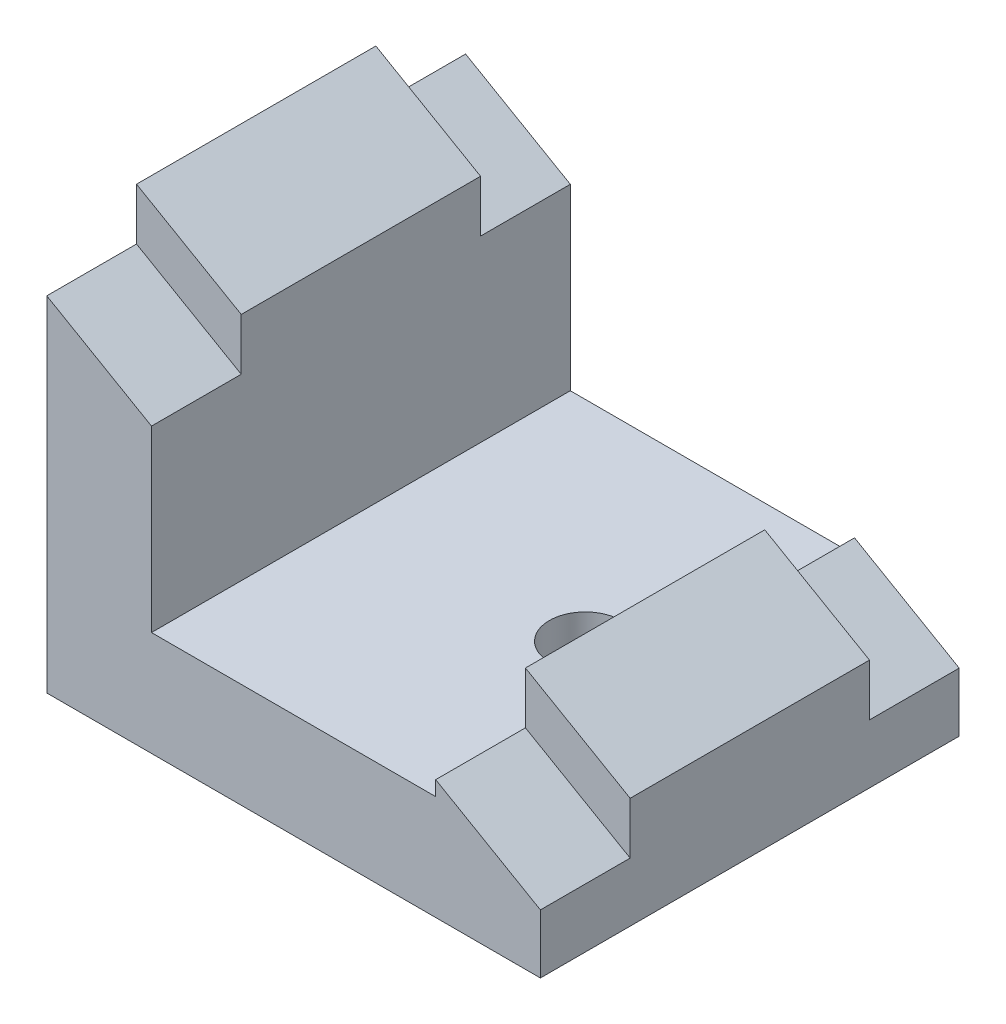
ISO-10303-21;
HEADER;
FILE_DESCRIPTION(('STEP AP214'),'2;1');
FILE_NAME('part.step','',(''),(''),'','','');
FILE_SCHEMA(('AUTOMOTIVE_DESIGN { 1 0 10303 214 1 1 1 1 }'));
ENDSEC;
DATA;
#1=APPLICATION_CONTEXT('core data for automotive mechanical design processes');
#2=APPLICATION_PROTOCOL_DEFINITION('international standard','automotive_design',2000,#1);
#3=PRODUCT_CONTEXT('',#1,'mechanical');
#4=PRODUCT('Part','Part','',(#3));
#5=PRODUCT_RELATED_PRODUCT_CATEGORY('part','',(#4));
#6=PRODUCT_DEFINITION_FORMATION('','',#4);
#7=PRODUCT_DEFINITION_CONTEXT('part definition',#1,'design');
#8=PRODUCT_DEFINITION('design','',#6,#7);
#9=PRODUCT_DEFINITION_SHAPE('','',#8);
#10=(LENGTH_UNIT() NAMED_UNIT(*) SI_UNIT(.MILLI.,.METRE.));
#11=(NAMED_UNIT(*) PLANE_ANGLE_UNIT() SI_UNIT($,.RADIAN.));
#12=(NAMED_UNIT(*) SI_UNIT($,.STERADIAN.) SOLID_ANGLE_UNIT());
#13=UNCERTAINTY_MEASURE_WITH_UNIT(LENGTH_MEASURE(1.E-05),#10,'distance_accuracy_value','');
#14=(GEOMETRIC_REPRESENTATION_CONTEXT(3) GLOBAL_UNCERTAINTY_ASSIGNED_CONTEXT((#13)) GLOBAL_UNIT_ASSIGNED_CONTEXT((#10,
#11,#12)) REPRESENTATION_CONTEXT('',''));
#15=CARTESIAN_POINT('',(0.,0.,0.));
#16=DIRECTION('',(0.,0.,1.));
#17=DIRECTION('',(1.,0.,0.));
#18=AXIS2_PLACEMENT_3D('',#15,#16,#17);
#19=CARTESIAN_POINT('',(4.,0.,7.));
#20=DIRECTION('',(1.,0.,0.));
#21=DIRECTION('',(0.,0.,-1.));
#22=AXIS2_PLACEMENT_3D('',#19,#20,#21);
#23=PLANE('',#22);
#24=DIRECTION('',(0.,1.,0.));
#25=VECTOR('',#24,1.);
#26=CARTESIAN_POINT('',(4.,0.,3.11561722730356));
#27=LINE('',#26,#25);
#28=CARTESIAN_POINT('',(4.00000000000001,0.,3.11561722730356));
#29=VERTEX_POINT('',#28);
#30=CARTESIAN_POINT('',(4.,2.,3.11561722730356));
#31=VERTEX_POINT('',#30);
#32=EDGE_CURVE('E182',#29,#31,#27,.T.);
#33=ORIENTED_EDGE('',*,*,#32,.F.);
#34=DIRECTION('',(0.,0.,-1.));
#35=VECTOR('',#34,1.);
#36=CARTESIAN_POINT('',(4.,0.,7.));
#37=LINE('',#36,#35);
#38=CARTESIAN_POINT('',(4.,0.,7.));
#39=VERTEX_POINT('',#38);
#40=EDGE_CURVE('E318',#39,#29,#37,.T.);
#41=ORIENTED_EDGE('',*,*,#40,.F.);
#42=DIRECTION('',(0.,-1.,0.));
#43=VECTOR('',#42,1.);
#44=CARTESIAN_POINT('',(4.,0.,7.));
#45=LINE('',#44,#43);
#46=CARTESIAN_POINT('',(4.,11.4974226119292,7.));
#47=VERTEX_POINT('',#46);
#48=EDGE_CURVE('E301',#47,#39,#45,.T.);
#49=ORIENTED_EDGE('',*,*,#48,.F.);
#50=DIRECTION('',(0.,0.,-1.));
#51=VECTOR('',#50,1.);
#52=CARTESIAN_POINT('',(4.,11.4974226119292,7.));
#53=LINE('',#52,#51);
#54=CARTESIAN_POINT('',(4.,11.4974226119292,4.));
#55=VERTEX_POINT('',#54);
#56=EDGE_CURVE('E59',#47,#55,#53,.T.);
#57=ORIENTED_EDGE('',*,*,#56,.T.);
#58=DIRECTION('',(0.,-1.,0.));
#59=VECTOR('',#58,1.);
#60=CARTESIAN_POINT('',(4.,13.2294734194974,4.));
#61=LINE('',#60,#59);
#62=CARTESIAN_POINT('',(4.,13.2294734194974,4.));
#63=VERTEX_POINT('',#62);
#64=EDGE_CURVE('E222',#63,#55,#61,.T.);
#65=ORIENTED_EDGE('',*,*,#64,.F.);
#66=DIRECTION('',(0.,0.,-1.));
#67=VECTOR('',#66,1.);
#68=CARTESIAN_POINT('',(4.,13.2294734194974,7.));
#69=LINE('',#68,#67);
#70=CARTESIAN_POINT('',(4.,13.2294734194974,-4.));
#71=VERTEX_POINT('',#70);
#72=EDGE_CURVE('E321',#63,#71,#69,.T.);
#73=ORIENTED_EDGE('',*,*,#72,.T.);
#74=DIRECTION('',(0.,-1.,0.));
#75=VECTOR('',#74,1.);
#76=CARTESIAN_POINT('',(4.,13.2294734194974,-4.));
#77=LINE('',#76,#75);
#78=CARTESIAN_POINT('',(4.,11.4974226119292,-4.));
#79=VERTEX_POINT('',#78);
#80=EDGE_CURVE('E257',#71,#79,#77,.T.);
#81=ORIENTED_EDGE('',*,*,#80,.T.);
#82=DIRECTION('',(0.,0.,1.));
#83=VECTOR('',#82,1.);
#84=CARTESIAN_POINT('',(4.,11.4974226119292,-7.));
#85=LINE('',#84,#83);
#86=CARTESIAN_POINT('',(4.,11.4974226119292,-7.));
#87=VERTEX_POINT('',#86);
#88=EDGE_CURVE('E252',#87,#79,#85,.T.);
#89=ORIENTED_EDGE('',*,*,#88,.F.);
#90=DIRECTION('',(0.,-1.,0.));
#91=VECTOR('',#90,1.);
#92=CARTESIAN_POINT('',(4.,0.,-7.));
#93=LINE('',#92,#91);
#94=CARTESIAN_POINT('',(4.,0.,-7.));
#95=VERTEX_POINT('',#94);
#96=EDGE_CURVE('E291',#87,#95,#93,.T.);
#97=ORIENTED_EDGE('',*,*,#96,.T.);
#98=CARTESIAN_POINT('',(4.,0.,-3.11561722730356));
#99=VERTEX_POINT('',#98);
#100=EDGE_CURVE('E303',#99,#95,#37,.T.);
#101=ORIENTED_EDGE('',*,*,#100,.F.);
#102=DIRECTION('',(0.,1.,0.));
#103=VECTOR('',#102,1.);
#104=CARTESIAN_POINT('',(4.,0.,-3.11561722730356));
#105=LINE('',#104,#103);
#106=CARTESIAN_POINT('',(4.,2.,-3.11561722730356));
#107=VERTEX_POINT('',#106);
#108=EDGE_CURVE('E51',#99,#107,#105,.T.);
#109=ORIENTED_EDGE('',*,*,#108,.T.);
#110=DIRECTION('',(0.,0.,1.));
#111=VECTOR('',#110,1.);
#112=CARTESIAN_POINT('',(4.,2.,7.));
#113=LINE('',#112,#111);
#114=EDGE_CURVE('E201',#107,#31,#113,.T.);
#115=ORIENTED_EDGE('',*,*,#114,.T.);
#116=EDGE_LOOP('',(#33,#41,#49,#57,#65,#73,#81,#89,#97,#101,#109,#115));
#117=FACE_BOUND('',#116,.T.);
#118=ADVANCED_FACE('F35',(#117),#23,.F.);
#119=CARTESIAN_POINT('',(20.5,0.,7.));
#120=DIRECTION('',(0.,1.,0.));
#121=DIRECTION('',(-1.,0.,0.));
#122=AXIS2_PLACEMENT_3D('',#119,#120,#121);
#123=PLANE('',#122);
#124=DIRECTION('',(0.99498743710662,0.,-0.1));
#125=VECTOR('',#124,1.);
#126=CARTESIAN_POINT('',(0.350000000000001,0.,3.48245602987317));
#127=LINE('',#126,#125);
#128=CARTESIAN_POINT('',(15.2,0.,1.98997487421324));
#129=VERTEX_POINT('',#128);
#130=EDGE_CURVE('E210',#29,#129,#127,.T.);
#131=ORIENTED_EDGE('',*,*,#130,.T.);
#132=CARTESIAN_POINT('',(15.,0.,0.));
#133=DIRECTION('',(0.,1.,0.));
#134=DIRECTION('',(0.,0.,1.));
#135=AXIS2_PLACEMENT_3D('',#132,#133,#134);
#136=CIRCLE('',#135,2.);
#137=CARTESIAN_POINT('',(15.2,0.,-1.98997487421324));
#138=VERTEX_POINT('',#137);
#139=EDGE_CURVE('E197',#129,#138,#136,.T.);
#140=ORIENTED_EDGE('',*,*,#139,.T.);
#141=DIRECTION('',(0.99498743710662,0.,0.1));
#142=VECTOR('',#141,1.);
#143=CARTESIAN_POINT('',(0.35,0.,-3.48245602987317));
#144=LINE('',#143,#142);
#145=EDGE_CURVE('E186',#99,#138,#144,.T.);
#146=ORIENTED_EDGE('',*,*,#145,.F.);
#147=ORIENTED_EDGE('',*,*,#100,.T.);
#148=DIRECTION('',(1.,0.,0.));
#149=VECTOR('',#148,1.);
#150=CARTESIAN_POINT('',(20.5,0.,-7.));
#151=LINE('',#150,#149);
#152=CARTESIAN_POINT('',(20.5,0.,-7.));
#153=VERTEX_POINT('',#152);
#154=EDGE_CURVE('E268',#95,#153,#151,.T.);
#155=ORIENTED_EDGE('',*,*,#154,.T.);
#156=DIRECTION('',(0.,0.,-1.));
#157=VECTOR('',#156,1.);
#158=CARTESIAN_POINT('',(20.5,0.,7.));
#159=LINE('',#158,#157);
#160=CARTESIAN_POINT('',(20.5,0.,7.));
#161=VERTEX_POINT('',#160);
#162=EDGE_CURVE('E11',#161,#153,#159,.T.);
#163=ORIENTED_EDGE('',*,*,#162,.F.);
#164=DIRECTION('',(1.,0.,0.));
#165=VECTOR('',#164,1.);
#166=CARTESIAN_POINT('',(20.5,0.,7.));
#167=LINE('',#166,#165);
#168=EDGE_CURVE('E287',#39,#161,#167,.T.);
#169=ORIENTED_EDGE('',*,*,#168,.F.);
#170=ORIENTED_EDGE('',*,*,#40,.T.);
#171=EDGE_LOOP('',(#131,#140,#146,#147,#155,#163,#169,#170));
#172=FACE_BOUND('',#171,.T.);
#173=ADVANCED_FACE('F37',(#172),#123,.F.);
#174=CARTESIAN_POINT('',(20.5,3.70319397786859,7.));
#175=DIRECTION('',(-1.,0.,0.));
#176=DIRECTION('',(0.,0.,1.));
#177=AXIS2_PLACEMENT_3D('',#174,#175,#176);
#178=PLANE('',#177);
#179=DIRECTION('',(0.,0.,-1.));
#180=VECTOR('',#179,1.);
#181=CARTESIAN_POINT('',(20.5,1.97114317030034,7.));
#182=LINE('',#181,#180);
#183=CARTESIAN_POINT('',(20.5,1.97114317030034,7.));
#184=VERTEX_POINT('',#183);
#185=CARTESIAN_POINT('',(20.5,1.97114317030034,4.));
#186=VERTEX_POINT('',#185);
#187=EDGE_CURVE('E237',#184,#186,#182,.T.);
#188=ORIENTED_EDGE('',*,*,#187,.F.);
#189=DIRECTION('',(0.,1.,0.));
#190=VECTOR('',#189,1.);
#191=CARTESIAN_POINT('',(20.5,3.70319397786859,7.));
#192=LINE('',#191,#190);
#193=EDGE_CURVE('E290',#161,#184,#192,.T.);
#194=ORIENTED_EDGE('',*,*,#193,.F.);
#195=ORIENTED_EDGE('',*,*,#162,.T.);
#196=DIRECTION('',(0.,1.,0.));
#197=VECTOR('',#196,1.);
#198=CARTESIAN_POINT('',(20.5,3.70319397786859,-7.));
#199=LINE('',#198,#197);
#200=CARTESIAN_POINT('',(20.5,1.97114317030033,-7.));
#201=VERTEX_POINT('',#200);
#202=EDGE_CURVE('E306',#153,#201,#199,.T.);
#203=ORIENTED_EDGE('',*,*,#202,.T.);
#204=DIRECTION('',(0.,0.,1.));
#205=VECTOR('',#204,1.);
#206=CARTESIAN_POINT('',(20.5,1.97114317030034,-7.));
#207=LINE('',#206,#205);
#208=CARTESIAN_POINT('',(20.5,1.97114317030034,-4.));
#209=VERTEX_POINT('',#208);
#210=EDGE_CURVE('E258',#201,#209,#207,.T.);
#211=ORIENTED_EDGE('',*,*,#210,.T.);
#212=DIRECTION('',(0.,1.,0.));
#213=VECTOR('',#212,1.);
#214=CARTESIAN_POINT('',(20.5,1.97114317030034,-4.));
#215=LINE('',#214,#213);
#216=CARTESIAN_POINT('',(20.5,3.70319397786859,-4.));
#217=VERTEX_POINT('',#216);
#218=EDGE_CURVE('E274',#209,#217,#215,.T.);
#219=ORIENTED_EDGE('',*,*,#218,.T.);
#220=DIRECTION('',(0.,0.,-1.));
#221=VECTOR('',#220,1.);
#222=CARTESIAN_POINT('',(20.5,3.70319397786859,7.));
#223=LINE('',#222,#221);
#224=CARTESIAN_POINT('',(20.5,3.70319397786859,4.));
#225=VERTEX_POINT('',#224);
#226=EDGE_CURVE('E44',#225,#217,#223,.T.);
#227=ORIENTED_EDGE('',*,*,#226,.F.);
#228=DIRECTION('',(0.,1.,0.));
#229=VECTOR('',#228,1.);
#230=CARTESIAN_POINT('',(20.5,1.97114317030034,4.));
#231=LINE('',#230,#229);
#232=EDGE_CURVE('E240',#186,#225,#231,.T.);
#233=ORIENTED_EDGE('',*,*,#232,.F.);
#234=EDGE_LOOP('',(#188,#194,#195,#203,#211,#219,#227,#233));
#235=FACE_BOUND('',#234,.T.);
#236=ADVANCED_FACE('F347',(#235),#178,.F.);
#237=CARTESIAN_POINT('',(17.,3.5,7.));
#238=DIRECTION('',(1.,0.,0.));
#239=DIRECTION('',(0.,0.,-1.));
#240=AXIS2_PLACEMENT_3D('',#237,#238,#239);
#241=PLANE('',#240);
#242=DIRECTION('',(0.,0.,-1.));
#243=VECTOR('',#242,1.);
#244=CARTESIAN_POINT('',(17.,3.99186911246403,7.));
#245=LINE('',#244,#243);
#246=CARTESIAN_POINT('',(17.,3.99186911246402,7.));
#247=VERTEX_POINT('',#246);
#248=CARTESIAN_POINT('',(17.,3.99186911246403,4.));
#249=VERTEX_POINT('',#248);
#250=EDGE_CURVE('E226',#247,#249,#245,.T.);
#251=ORIENTED_EDGE('',*,*,#250,.T.);
#252=DIRECTION('',(0.,-1.,0.));
#253=VECTOR('',#252,1.);
#254=CARTESIAN_POINT('',(17.,5.72391992003228,4.));
#255=LINE('',#254,#253);
#256=CARTESIAN_POINT('',(17.,5.72391992003228,4.));
#257=VERTEX_POINT('',#256);
#258=EDGE_CURVE('E238',#257,#249,#255,.T.);
#259=ORIENTED_EDGE('',*,*,#258,.F.);
#260=DIRECTION('',(0.,0.,-1.));
#261=VECTOR('',#260,1.);
#262=CARTESIAN_POINT('',(17.,5.72391992003228,7.));
#263=LINE('',#262,#261);
#264=CARTESIAN_POINT('',(17.,5.72391992003228,-4.));
#265=VERTEX_POINT('',#264);
#266=EDGE_CURVE('E331',#257,#265,#263,.T.);
#267=ORIENTED_EDGE('',*,*,#266,.T.);
#268=DIRECTION('',(0.,-1.,0.));
#269=VECTOR('',#268,1.);
#270=CARTESIAN_POINT('',(17.,5.72391992003228,-4.));
#271=LINE('',#270,#269);
#272=CARTESIAN_POINT('',(17.,3.99186911246403,-4.));
#273=VERTEX_POINT('',#272);
#274=EDGE_CURVE('E277',#265,#273,#271,.T.);
#275=ORIENTED_EDGE('',*,*,#274,.T.);
#276=DIRECTION('',(0.,0.,1.));
#277=VECTOR('',#276,1.);
#278=CARTESIAN_POINT('',(17.,3.99186911246403,-7.));
#279=LINE('',#278,#277);
#280=CARTESIAN_POINT('',(17.,3.99186911246403,-7.));
#281=VERTEX_POINT('',#280);
#282=EDGE_CURVE('E273',#281,#273,#279,.T.);
#283=ORIENTED_EDGE('',*,*,#282,.F.);
#284=DIRECTION('',(0.,-1.,0.));
#285=VECTOR('',#284,1.);
#286=CARTESIAN_POINT('',(17.,3.5,-7.));
#287=LINE('',#286,#285);
#288=CARTESIAN_POINT('',(17.,3.5,-7.));
#289=VERTEX_POINT('',#288);
#290=EDGE_CURVE('E309',#281,#289,#287,.T.);
#291=ORIENTED_EDGE('',*,*,#290,.T.);
#292=DIRECTION('',(0.,0.,-1.));
#293=VECTOR('',#292,1.);
#294=CARTESIAN_POINT('',(17.,3.5,7.));
#295=LINE('',#294,#293);
#296=CARTESIAN_POINT('',(17.,3.5,7.));
#297=VERTEX_POINT('',#296);
#298=EDGE_CURVE('E328',#297,#289,#295,.T.);
#299=ORIENTED_EDGE('',*,*,#298,.F.);
#300=DIRECTION('',(0.,-1.,0.));
#301=VECTOR('',#300,1.);
#302=CARTESIAN_POINT('',(17.,3.5,7.));
#303=LINE('',#302,#301);
#304=EDGE_CURVE('E294',#247,#297,#303,.T.);
#305=ORIENTED_EDGE('',*,*,#304,.F.);
#306=EDGE_LOOP('',(#251,#259,#267,#275,#283,#291,#299,#305));
#307=FACE_BOUND('',#306,.T.);
#308=ADVANCED_FACE('F359',(#307),#241,.F.);
#309=CARTESIAN_POINT('',(7.5,11.2087474773337,7.));
#310=DIRECTION('',(-1.,0.,0.));
#311=DIRECTION('',(0.,-1.,0.));
#312=AXIS2_PLACEMENT_3D('',#309,#310,#311);
#313=PLANE('',#312);
#314=DIRECTION('',(0.,0.,-1.));
#315=VECTOR('',#314,1.);
#316=CARTESIAN_POINT('',(7.50000000000001,9.47669666976547,7.));
#317=LINE('',#316,#315);
#318=CARTESIAN_POINT('',(7.50000000000001,9.47669666976547,7.));
#319=VERTEX_POINT('',#318);
#320=CARTESIAN_POINT('',(7.50000000000001,9.47669666976547,4.));
#321=VERTEX_POINT('',#320);
#322=EDGE_CURVE('E221',#319,#321,#317,.T.);
#323=ORIENTED_EDGE('',*,*,#322,.F.);
#324=DIRECTION('',(0.,1.,0.));
#325=VECTOR('',#324,1.);
#326=CARTESIAN_POINT('',(7.5,11.2087474773337,7.));
#327=LINE('',#326,#325);
#328=CARTESIAN_POINT('',(7.50000000000001,3.5,7.));
#329=VERTEX_POINT('',#328);
#330=EDGE_CURVE('E298',#329,#319,#327,.T.);
#331=ORIENTED_EDGE('',*,*,#330,.F.);
#332=DIRECTION('',(0.,0.,-1.));
#333=VECTOR('',#332,1.);
#334=CARTESIAN_POINT('',(7.50000000000001,3.5,7.));
#335=LINE('',#334,#333);
#336=CARTESIAN_POINT('',(7.50000000000001,3.5,-7.));
#337=VERTEX_POINT('',#336);
#338=EDGE_CURVE('E325',#329,#337,#335,.T.);
#339=ORIENTED_EDGE('',*,*,#338,.T.);
#340=DIRECTION('',(0.,1.,0.));
#341=VECTOR('',#340,1.);
#342=CARTESIAN_POINT('',(7.5,11.2087474773337,-7.));
#343=LINE('',#342,#341);
#344=CARTESIAN_POINT('',(7.5,9.47669666976548,-7.));
#345=VERTEX_POINT('',#344);
#346=EDGE_CURVE('E313',#337,#345,#343,.T.);
#347=ORIENTED_EDGE('',*,*,#346,.T.);
#348=DIRECTION('',(0.,0.,1.));
#349=VECTOR('',#348,1.);
#350=CARTESIAN_POINT('',(7.50000000000001,9.47669666976547,-7.));
#351=LINE('',#350,#349);
#352=CARTESIAN_POINT('',(7.50000000000001,9.47669666976547,-4.));
#353=VERTEX_POINT('',#352);
#354=EDGE_CURVE('E265',#345,#353,#351,.T.);
#355=ORIENTED_EDGE('',*,*,#354,.T.);
#356=DIRECTION('',(0.,1.,0.));
#357=VECTOR('',#356,1.);
#358=CARTESIAN_POINT('',(7.50000000000001,9.47669666976547,-4.));
#359=LINE('',#358,#357);
#360=CARTESIAN_POINT('',(7.5,11.2087474773337,-4.));
#361=VERTEX_POINT('',#360);
#362=EDGE_CURVE('E253',#353,#361,#359,.T.);
#363=ORIENTED_EDGE('',*,*,#362,.T.);
#364=DIRECTION('',(0.,0.,-1.));
#365=VECTOR('',#364,1.);
#366=CARTESIAN_POINT('',(7.5,11.2087474773337,7.));
#367=LINE('',#366,#365);
#368=CARTESIAN_POINT('',(7.5,11.2087474773337,4.));
#369=VERTEX_POINT('',#368);
#370=EDGE_CURVE('E323',#369,#361,#367,.T.);
#371=ORIENTED_EDGE('',*,*,#370,.F.);
#372=DIRECTION('',(0.,1.,0.));
#373=VECTOR('',#372,1.);
#374=CARTESIAN_POINT('',(7.50000000000001,9.47669666976547,4.));
#375=LINE('',#374,#373);
#376=EDGE_CURVE('E225',#321,#369,#375,.T.);
#377=ORIENTED_EDGE('',*,*,#376,.F.);
#378=EDGE_LOOP('',(#323,#331,#339,#347,#355,#363,#371,#377));
#379=FACE_BOUND('',#378,.T.);
#380=ADVANCED_FACE('F395',(#379),#313,.F.);
#381=CARTESIAN_POINT('',(0.,0.,7.));
#382=DIRECTION('',(0.,0.,-1.));
#383=DIRECTION('',(-1.,0.,0.));
#384=AXIS2_PLACEMENT_3D('',#381,#382,#383);
#385=PLANE('',#384);
#386=DIRECTION('',(0.866025403784438,-0.5,0.));
#387=VECTOR('',#386,1.);
#388=CARTESIAN_POINT('',(4.,11.4974226119292,7.));
#389=LINE('',#388,#387);
#390=EDGE_CURVE('E219',#47,#319,#389,.T.);
#391=ORIENTED_EDGE('',*,*,#390,.F.);
#392=ORIENTED_EDGE('',*,*,#48,.T.);
#393=ORIENTED_EDGE('',*,*,#168,.T.);
#394=ORIENTED_EDGE('',*,*,#193,.T.);
#395=DIRECTION('',(0.866025403784439,-0.5,0.));
#396=VECTOR('',#395,1.);
#397=CARTESIAN_POINT('',(17.,3.99186911246403,7.));
#398=LINE('',#397,#396);
#399=EDGE_CURVE('E235',#247,#184,#398,.T.);
#400=ORIENTED_EDGE('',*,*,#399,.F.);
#401=ORIENTED_EDGE('',*,*,#304,.T.);
#402=DIRECTION('',(-1.,0.,0.));
#403=VECTOR('',#402,1.);
#404=CARTESIAN_POINT('',(7.50000000000001,3.5,7.));
#405=LINE('',#404,#403);
#406=EDGE_CURVE('E296',#297,#329,#405,.T.);
#407=ORIENTED_EDGE('',*,*,#406,.T.);
#408=ORIENTED_EDGE('',*,*,#330,.T.);
#409=EDGE_LOOP('',(#391,#392,#393,#394,#400,#401,#407,#408));
#410=FACE_BOUND('',#409,.T.);
#411=ADVANCED_FACE('F367',(#410),#385,.F.);
#412=CARTESIAN_POINT('',(17.,5.72391992003228,7.));
#413=DIRECTION('',(-0.5,-0.866025403784439,0.));
#414=DIRECTION('',(0.866025403784439,-0.5,0.));
#415=AXIS2_PLACEMENT_3D('',#412,#413,#414);
#416=PLANE('',#415);
#417=ORIENTED_EDGE('',*,*,#266,.F.);
#418=DIRECTION('',(-0.866025403784439,0.5,0.));
#419=VECTOR('',#418,1.);
#420=CARTESIAN_POINT('',(20.5,3.70319397786859,4.));
#421=LINE('',#420,#419);
#422=EDGE_CURVE('E218',#225,#257,#421,.T.);
#423=ORIENTED_EDGE('',*,*,#422,.F.);
#424=ORIENTED_EDGE('',*,*,#226,.T.);
#425=DIRECTION('',(-0.866025403784439,0.5,0.));
#426=VECTOR('',#425,1.);
#427=CARTESIAN_POINT('',(20.5,3.70319397786859,-4.));
#428=LINE('',#427,#426);
#429=EDGE_CURVE('E232',#217,#265,#428,.T.);
#430=ORIENTED_EDGE('',*,*,#429,.T.);
#431=EDGE_LOOP('',(#417,#423,#424,#430));
#432=FACE_BOUND('',#431,.T.);
#433=ADVANCED_FACE('F338',(#432),#416,.F.);
#434=CARTESIAN_POINT('',(7.50000000000001,3.5,7.));
#435=DIRECTION('',(0.,-1.,0.));
#436=DIRECTION('',(0.,0.,-1.));
#437=AXIS2_PLACEMENT_3D('',#434,#435,#436);
#438=PLANE('',#437);
#439=CARTESIAN_POINT('',(15.,3.5,0.));
#440=DIRECTION('',(0.,-1.,0.));
#441=DIRECTION('',(0.,0.,-1.));
#442=AXIS2_PLACEMENT_3D('',#439,#440,#441);
#443=CIRCLE('',#442,1.2);
#444=CARTESIAN_POINT('',(15.,3.5,-1.2));
#445=VERTEX_POINT('',#444);
#446=EDGE_CURVE('E215',#445,#445,#443,.T.);
#447=ORIENTED_EDGE('',*,*,#446,.T.);
#448=EDGE_LOOP('',(#447));
#449=FACE_BOUND('',#448,.T.);
#450=DIRECTION('',(-1.,0.,0.));
#451=VECTOR('',#450,1.);
#452=CARTESIAN_POINT('',(7.50000000000001,3.5,-7.));
#453=LINE('',#452,#451);
#454=EDGE_CURVE('E311',#289,#337,#453,.T.);
#455=ORIENTED_EDGE('',*,*,#454,.T.);
#456=ORIENTED_EDGE('',*,*,#338,.F.);
#457=ORIENTED_EDGE('',*,*,#406,.F.);
#458=ORIENTED_EDGE('',*,*,#298,.T.);
#459=EDGE_LOOP('',(#455,#456,#457,#458));
#460=FACE_BOUND('',#459,.T.);
#461=ADVANCED_FACE('F363',(#449,#460),#438,.F.);
#462=CARTESIAN_POINT('',(4.,13.2294734194974,7.));
#463=DIRECTION('',(-0.5,-0.866025403784439,0.));
#464=DIRECTION('',(0.866025403784439,-0.5,0.));
#465=AXIS2_PLACEMENT_3D('',#462,#463,#464);
#466=PLANE('',#465);
#467=ORIENTED_EDGE('',*,*,#72,.F.);
#468=DIRECTION('',(-0.866025403784438,0.5,0.));
#469=VECTOR('',#468,1.);
#470=CARTESIAN_POINT('',(7.5,11.2087474773337,4.));
#471=LINE('',#470,#469);
#472=EDGE_CURVE('E223',#369,#63,#471,.T.);
#473=ORIENTED_EDGE('',*,*,#472,.F.);
#474=ORIENTED_EDGE('',*,*,#370,.T.);
#475=DIRECTION('',(-0.866025403784438,0.5,0.));
#476=VECTOR('',#475,1.);
#477=CARTESIAN_POINT('',(7.5,11.2087474773337,-4.));
#478=LINE('',#477,#476);
#479=EDGE_CURVE('E254',#361,#71,#478,.T.);
#480=ORIENTED_EDGE('',*,*,#479,.T.);
#481=EDGE_LOOP('',(#467,#473,#474,#480));
#482=FACE_BOUND('',#481,.T.);
#483=ADVANCED_FACE('F420',(#482),#466,.F.);
#484=CARTESIAN_POINT('',(0.,0.,-7.));
#485=DIRECTION('',(0.,0.,-1.));
#486=DIRECTION('',(-1.,0.,0.));
#487=AXIS2_PLACEMENT_3D('',#484,#485,#486);
#488=PLANE('',#487);
#489=DIRECTION('',(0.866025403784438,-0.5,0.));
#490=VECTOR('',#489,1.);
#491=CARTESIAN_POINT('',(4.,11.4974226119292,-7.));
#492=LINE('',#491,#490);
#493=EDGE_CURVE('E249',#87,#345,#492,.T.);
#494=ORIENTED_EDGE('',*,*,#493,.T.);
#495=ORIENTED_EDGE('',*,*,#346,.F.);
#496=ORIENTED_EDGE('',*,*,#454,.F.);
#497=ORIENTED_EDGE('',*,*,#290,.F.);
#498=DIRECTION('',(0.866025403784439,-0.5,0.));
#499=VECTOR('',#498,1.);
#500=CARTESIAN_POINT('',(17.,3.99186911246403,-7.));
#501=LINE('',#500,#499);
#502=EDGE_CURVE('E270',#281,#201,#501,.T.);
#503=ORIENTED_EDGE('',*,*,#502,.T.);
#504=ORIENTED_EDGE('',*,*,#202,.F.);
#505=ORIENTED_EDGE('',*,*,#154,.F.);
#506=ORIENTED_EDGE('',*,*,#96,.F.);
#507=EDGE_LOOP('',(#494,#495,#496,#497,#503,#504,#505,#506));
#508=FACE_BOUND('',#507,.T.);
#509=ADVANCED_FACE('F353',(#508),#488,.T.);
#510=CARTESIAN_POINT('',(17.,3.99186911246403,-7.));
#511=DIRECTION('',(-0.5,-0.866025403784439,0.));
#512=DIRECTION('',(0.866025403784439,-0.5,0.));
#513=AXIS2_PLACEMENT_3D('',#510,#511,#512);
#514=PLANE('',#513);
#515=DIRECTION('',(0.866025403784439,-0.5,0.));
#516=VECTOR('',#515,1.);
#517=CARTESIAN_POINT('',(17.,3.99186911246403,-4.));
#518=LINE('',#517,#516);
#519=EDGE_CURVE('E280',#273,#209,#518,.T.);
#520=ORIENTED_EDGE('',*,*,#519,.T.);
#521=ORIENTED_EDGE('',*,*,#210,.F.);
#522=ORIENTED_EDGE('',*,*,#502,.F.);
#523=ORIENTED_EDGE('',*,*,#282,.T.);
#524=EDGE_LOOP('',(#520,#521,#522,#523));
#525=FACE_BOUND('',#524,.T.);
#526=ADVANCED_FACE('F349',(#525),#514,.F.);
#527=CARTESIAN_POINT('',(0.,0.,-4.));
#528=DIRECTION('',(0.,0.,1.));
#529=DIRECTION('',(1.,0.,0.));
#530=AXIS2_PLACEMENT_3D('',#527,#528,#529);
#531=PLANE('',#530);
#532=ORIENTED_EDGE('',*,*,#429,.F.);
#533=ORIENTED_EDGE('',*,*,#218,.F.);
#534=ORIENTED_EDGE('',*,*,#519,.F.);
#535=ORIENTED_EDGE('',*,*,#274,.F.);
#536=EDGE_LOOP('',(#532,#533,#534,#535));
#537=FACE_BOUND('',#536,.T.);
#538=ADVANCED_FACE('F344',(#537),#531,.F.);
#539=CARTESIAN_POINT('',(4.,11.4974226119292,-7.));
#540=DIRECTION('',(-0.5,-0.866025403784439,0.));
#541=DIRECTION('',(0.866025403784439,-0.5,0.));
#542=AXIS2_PLACEMENT_3D('',#539,#540,#541);
#543=PLANE('',#542);
#544=DIRECTION('',(0.866025403784438,-0.5,0.));
#545=VECTOR('',#544,1.);
#546=CARTESIAN_POINT('',(4.,11.4974226119292,-4.));
#547=LINE('',#546,#545);
#548=EDGE_CURVE('E261',#79,#353,#547,.T.);
#549=ORIENTED_EDGE('',*,*,#548,.T.);
#550=ORIENTED_EDGE('',*,*,#354,.F.);
#551=ORIENTED_EDGE('',*,*,#493,.F.);
#552=ORIENTED_EDGE('',*,*,#88,.T.);
#553=EDGE_LOOP('',(#549,#550,#551,#552));
#554=FACE_BOUND('',#553,.T.);
#555=ADVANCED_FACE('F387',(#554),#543,.F.);
#556=CARTESIAN_POINT('',(0.,0.,-4.));
#557=DIRECTION('',(0.,0.,1.));
#558=DIRECTION('',(1.,0.,0.));
#559=AXIS2_PLACEMENT_3D('',#556,#557,#558);
#560=PLANE('',#559);
#561=ORIENTED_EDGE('',*,*,#479,.F.);
#562=ORIENTED_EDGE('',*,*,#362,.F.);
#563=ORIENTED_EDGE('',*,*,#548,.F.);
#564=ORIENTED_EDGE('',*,*,#80,.F.);
#565=EDGE_LOOP('',(#561,#562,#563,#564));
#566=FACE_BOUND('',#565,.T.);
#567=ADVANCED_FACE('F391',(#566),#560,.F.);
#568=CARTESIAN_POINT('',(17.,3.99186911246403,7.));
#569=DIRECTION('',(0.5,0.866025403784439,0.));
#570=DIRECTION('',(-0.866025403784439,0.5,0.));
#571=AXIS2_PLACEMENT_3D('',#568,#569,#570);
#572=PLANE('',#571);
#573=DIRECTION('',(0.866025403784439,-0.5,0.));
#574=VECTOR('',#573,1.);
#575=CARTESIAN_POINT('',(17.,3.99186911246403,4.));
#576=LINE('',#575,#574);
#577=EDGE_CURVE('E242',#249,#186,#576,.T.);
#578=ORIENTED_EDGE('',*,*,#577,.F.);
#579=ORIENTED_EDGE('',*,*,#250,.F.);
#580=ORIENTED_EDGE('',*,*,#399,.T.);
#581=ORIENTED_EDGE('',*,*,#187,.T.);
#582=EDGE_LOOP('',(#578,#579,#580,#581));
#583=FACE_BOUND('',#582,.T.);
#584=ADVANCED_FACE('F372',(#583),#572,.T.);
#585=CARTESIAN_POINT('',(0.,0.,4.));
#586=DIRECTION('',(0.,0.,-1.));
#587=DIRECTION('',(1.,0.,0.));
#588=AXIS2_PLACEMENT_3D('',#585,#586,#587);
#589=PLANE('',#588);
#590=ORIENTED_EDGE('',*,*,#422,.T.);
#591=ORIENTED_EDGE('',*,*,#258,.T.);
#592=ORIENTED_EDGE('',*,*,#577,.T.);
#593=ORIENTED_EDGE('',*,*,#232,.T.);
#594=EDGE_LOOP('',(#590,#591,#592,#593));
#595=FACE_BOUND('',#594,.T.);
#596=ADVANCED_FACE('F374',(#595),#589,.F.);
#597=CARTESIAN_POINT('',(4.,11.4974226119292,7.));
#598=DIRECTION('',(0.5,0.866025403784439,0.));
#599=DIRECTION('',(-0.866025403784439,0.5,0.));
#600=AXIS2_PLACEMENT_3D('',#597,#598,#599);
#601=PLANE('',#600);
#602=DIRECTION('',(0.866025403784438,-0.5,0.));
#603=VECTOR('',#602,1.);
#604=CARTESIAN_POINT('',(4.,11.4974226119292,4.));
#605=LINE('',#604,#603);
#606=EDGE_CURVE('E228',#55,#321,#605,.T.);
#607=ORIENTED_EDGE('',*,*,#606,.F.);
#608=ORIENTED_EDGE('',*,*,#56,.F.);
#609=ORIENTED_EDGE('',*,*,#390,.T.);
#610=ORIENTED_EDGE('',*,*,#322,.T.);
#611=EDGE_LOOP('',(#607,#608,#609,#610));
#612=FACE_BOUND('',#611,.T.);
#613=ADVANCED_FACE('F397',(#612),#601,.T.);
#614=CARTESIAN_POINT('',(0.,0.,4.));
#615=DIRECTION('',(0.,0.,-1.));
#616=DIRECTION('',(1.,0.,0.));
#617=AXIS2_PLACEMENT_3D('',#614,#615,#616);
#618=PLANE('',#617);
#619=ORIENTED_EDGE('',*,*,#472,.T.);
#620=ORIENTED_EDGE('',*,*,#64,.T.);
#621=ORIENTED_EDGE('',*,*,#606,.T.);
#622=ORIENTED_EDGE('',*,*,#376,.T.);
#623=EDGE_LOOP('',(#619,#620,#621,#622));
#624=FACE_BOUND('',#623,.T.);
#625=ADVANCED_FACE('F510',(#624),#618,.F.);
#626=CARTESIAN_POINT('',(15.,0.,0.));
#627=DIRECTION('',(0.,-1.,0.));
#628=DIRECTION('',(0.,0.,-1.));
#629=AXIS2_PLACEMENT_3D('',#626,#627,#628);
#630=CYLINDRICAL_SURFACE('',#629,1.2);
#631=CARTESIAN_POINT('',(15.,2.,0.));
#632=DIRECTION('',(0.,1.,0.));
#633=DIRECTION('',(0.,0.,1.));
#634=AXIS2_PLACEMENT_3D('',#631,#632,#633);
#635=CIRCLE('',#634,1.2);
#636=CARTESIAN_POINT('',(15.,2.,1.2));
#637=VERTEX_POINT('',#636);
#638=EDGE_CURVE('E39',#637,#637,#635,.F.);
#639=ORIENTED_EDGE('',*,*,#638,.T.);
#640=EDGE_LOOP('',(#639));
#641=FACE_BOUND('',#640,.T.);
#642=ORIENTED_EDGE('',*,*,#446,.F.);
#643=EDGE_LOOP('',(#642));
#644=FACE_BOUND('',#643,.T.);
#645=ADVANCED_FACE('F409',(#641,#644),#630,.F.);
#646=CARTESIAN_POINT('',(0.350000000000001,2.,3.48245602987317));
#647=DIRECTION('',(-0.1,0.,-0.99498743710662));
#648=DIRECTION('',(-0.99498743710662,0.,0.1));
#649=AXIS2_PLACEMENT_3D('',#646,#647,#648);
#650=PLANE('',#649);
#651=ORIENTED_EDGE('',*,*,#32,.T.);
#652=DIRECTION('',(0.99498743710662,0.,-0.1));
#653=VECTOR('',#652,1.);
#654=CARTESIAN_POINT('',(0.350000000000001,2.,3.48245602987317));
#655=LINE('',#654,#653);
#656=CARTESIAN_POINT('',(15.2,2.,1.98997487421324));
#657=VERTEX_POINT('',#656);
#658=EDGE_CURVE('E175',#31,#657,#655,.T.);
#659=ORIENTED_EDGE('',*,*,#658,.T.);
#660=DIRECTION('',(0.,-1.,0.));
#661=VECTOR('',#660,1.);
#662=CARTESIAN_POINT('',(15.2,2.,1.98997487421324));
#663=LINE('',#662,#661);
#664=EDGE_CURVE('E179',#657,#129,#663,.T.);
#665=ORIENTED_EDGE('',*,*,#664,.T.);
#666=ORIENTED_EDGE('',*,*,#130,.F.);
#667=EDGE_LOOP('',(#651,#659,#665,#666));
#668=FACE_BOUND('',#667,.T.);
#669=ADVANCED_FACE('F177',(#668),#650,.T.);
#670=CARTESIAN_POINT('',(0.35,2.,-3.48245602987317));
#671=DIRECTION('',(0.1,0.,-0.99498743710662));
#672=DIRECTION('',(-0.99498743710662,0.,-0.1));
#673=AXIS2_PLACEMENT_3D('',#670,#671,#672);
#674=PLANE('',#673);
#675=ORIENTED_EDGE('',*,*,#145,.T.);
#676=DIRECTION('',(0.,-1.,0.));
#677=VECTOR('',#676,1.);
#678=CARTESIAN_POINT('',(15.2,2.,-1.98997487421324));
#679=LINE('',#678,#677);
#680=CARTESIAN_POINT('',(15.2,2.,-1.98997487421324));
#681=VERTEX_POINT('',#680);
#682=EDGE_CURVE('E198',#681,#138,#679,.T.);
#683=ORIENTED_EDGE('',*,*,#682,.F.);
#684=DIRECTION('',(0.99498743710662,0.,0.1));
#685=VECTOR('',#684,1.);
#686=CARTESIAN_POINT('',(0.35,2.,-3.48245602987317));
#687=LINE('',#686,#685);
#688=EDGE_CURVE('E190',#107,#681,#687,.T.);
#689=ORIENTED_EDGE('',*,*,#688,.F.);
#690=ORIENTED_EDGE('',*,*,#108,.F.);
#691=EDGE_LOOP('',(#675,#683,#689,#690));
#692=FACE_BOUND('',#691,.T.);
#693=ADVANCED_FACE('F400',(#692),#674,.F.);
#694=CARTESIAN_POINT('',(0.,2.,0.));
#695=DIRECTION('',(0.,1.,0.));
#696=DIRECTION('',(0.,0.,1.));
#697=AXIS2_PLACEMENT_3D('',#694,#695,#696);
#698=PLANE('',#697);
#699=ORIENTED_EDGE('',*,*,#638,.F.);
#700=EDGE_LOOP('',(#699));
#701=FACE_BOUND('',#700,.T.);
#702=ORIENTED_EDGE('',*,*,#688,.T.);
#703=CARTESIAN_POINT('',(15.,2.,0.));
#704=DIRECTION('',(0.,1.,0.));
#705=DIRECTION('',(0.,0.,1.));
#706=AXIS2_PLACEMENT_3D('',#703,#704,#705);
#707=CIRCLE('',#706,2.);
#708=EDGE_CURVE('E185',#657,#681,#707,.T.);
#709=ORIENTED_EDGE('',*,*,#708,.F.);
#710=ORIENTED_EDGE('',*,*,#658,.F.);
#711=ORIENTED_EDGE('',*,*,#114,.F.);
#712=EDGE_LOOP('',(#702,#709,#710,#711));
#713=FACE_BOUND('',#712,.T.);
#714=ADVANCED_FACE('F189',(#701,#713),#698,.F.);
#715=CARTESIAN_POINT('',(15.,2.,0.));
#716=DIRECTION('',(0.,-1.,0.));
#717=DIRECTION('',(0.,0.,-1.));
#718=AXIS2_PLACEMENT_3D('',#715,#716,#717);
#719=CYLINDRICAL_SURFACE('',#718,2.);
#720=ORIENTED_EDGE('',*,*,#139,.F.);
#721=ORIENTED_EDGE('',*,*,#664,.F.);
#722=ORIENTED_EDGE('',*,*,#708,.T.);
#723=ORIENTED_EDGE('',*,*,#682,.T.);
#724=EDGE_LOOP('',(#720,#721,#722,#723));
#725=FACE_BOUND('',#724,.T.);
#726=ADVANCED_FACE('F195',(#725),#719,.F.);
#727=CLOSED_SHELL('',(#118,#173,#236,#308,#380,#411,#433,#461,#483,#509,#526,#538,#555,#567,
#584,#596,#613,#625,#645,#669,#693,#714,#726));
#728=MANIFOLD_SOLID_BREP('B2',#727);
#729=ADVANCED_BREP_SHAPE_REPRESENTATION('',(#18,#728),#14);
#730=SHAPE_DEFINITION_REPRESENTATION(#9,#729);
ENDSEC;
END-ISO-10303-21;
